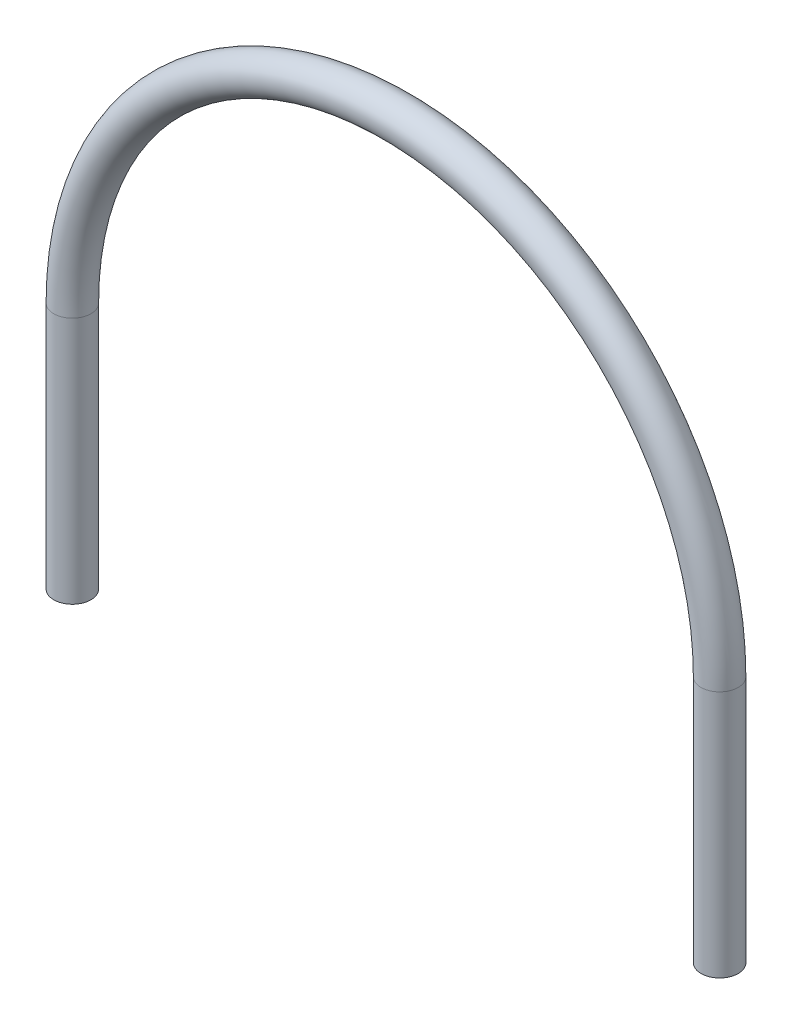
ISO-10303-21;
HEADER;
FILE_DESCRIPTION(('STEP AP214'),'2;1');
FILE_NAME('part.step','',(''),(''),'','','');
FILE_SCHEMA(('AUTOMOTIVE_DESIGN { 1 0 10303 214 1 1 1 1 }'));
ENDSEC;
DATA;
#1=APPLICATION_CONTEXT('core data for automotive mechanical design processes');
#2=APPLICATION_PROTOCOL_DEFINITION('international standard','automotive_design',2000,#1);
#3=PRODUCT_CONTEXT('',#1,'mechanical');
#4=PRODUCT('Part','Part','',(#3));
#5=PRODUCT_RELATED_PRODUCT_CATEGORY('part','',(#4));
#6=PRODUCT_DEFINITION_FORMATION('','',#4);
#7=PRODUCT_DEFINITION_CONTEXT('part definition',#1,'design');
#8=PRODUCT_DEFINITION('design','',#6,#7);
#9=PRODUCT_DEFINITION_SHAPE('','',#8);
#10=(LENGTH_UNIT() NAMED_UNIT(*) SI_UNIT(.MILLI.,.METRE.));
#11=(NAMED_UNIT(*) PLANE_ANGLE_UNIT() SI_UNIT($,.RADIAN.));
#12=(NAMED_UNIT(*) SI_UNIT($,.STERADIAN.) SOLID_ANGLE_UNIT());
#13=UNCERTAINTY_MEASURE_WITH_UNIT(LENGTH_MEASURE(1.E-05),#10,'distance_accuracy_value','');
#14=(GEOMETRIC_REPRESENTATION_CONTEXT(3) GLOBAL_UNCERTAINTY_ASSIGNED_CONTEXT((#13)) GLOBAL_UNIT_ASSIGNED_CONTEXT((#10,
#11,#12)) REPRESENTATION_CONTEXT('',''));
#15=CARTESIAN_POINT('',(0.,0.,0.));
#16=DIRECTION('',(0.,0.,1.));
#17=DIRECTION('',(1.,0.,0.));
#18=AXIS2_PLACEMENT_3D('',#15,#16,#17);
#19=CARTESIAN_POINT('',(1589.23291946056,-400.,0.));
#20=DIRECTION('',(0.,-1.,0.));
#21=DIRECTION('',(0.,0.,1.));
#22=AXIS2_PLACEMENT_3D('',#19,#20,#21);
#23=PLANE('',#22);
#24=CARTESIAN_POINT('',(1589.23291946056,-400.,0.));
#25=DIRECTION('',(0.,-1.,0.));
#26=DIRECTION('',(0.,0.,-1.));
#27=AXIS2_PLACEMENT_3D('',#24,#25,#26);
#28=CIRCLE('',#27,27.);
#29=CARTESIAN_POINT('',(1589.23291946056,-400.,-27.));
#30=VERTEX_POINT('',#29);
#31=EDGE_CURVE('E38',#30,#30,#28,.T.);
#32=ORIENTED_EDGE('',*,*,#31,.F.);
#33=EDGE_LOOP('',(#32));
#34=FACE_BOUND('',#33,.T.);
#35=CARTESIAN_POINT('',(1589.23291946056,-400.,0.));
#36=DIRECTION('',(0.,-1.,0.));
#37=DIRECTION('',(0.,0.,1.));
#38=AXIS2_PLACEMENT_3D('',#35,#36,#37);
#39=CIRCLE('',#38,30.);
#40=CARTESIAN_POINT('',(1589.23291946056,-400.,30.));
#41=VERTEX_POINT('',#40);
#42=EDGE_CURVE('E29',#41,#41,#39,.T.);
#43=ORIENTED_EDGE('',*,*,#42,.T.);
#44=EDGE_LOOP('',(#43));
#45=FACE_BOUND('',#44,.T.);
#46=ADVANCED_FACE('F15',(#34,#45),#23,.T.);
#47=CARTESIAN_POINT('',(544.23291946056,-400.,0.));
#48=DIRECTION('',(0.,1.,0.));
#49=DIRECTION('',(0.,0.,1.));
#50=AXIS2_PLACEMENT_3D('',#47,#48,#49);
#51=PLANE('',#50);
#52=CARTESIAN_POINT('',(544.23291946056,-400.,0.));
#53=DIRECTION('',(0.,1.,0.));
#54=DIRECTION('',(0.,0.,1.));
#55=AXIS2_PLACEMENT_3D('',#52,#53,#54);
#56=CIRCLE('',#55,27.);
#57=CARTESIAN_POINT('',(544.23291946056,-400.,27.));
#58=VERTEX_POINT('',#57);
#59=EDGE_CURVE('E34',#58,#58,#56,.T.);
#60=ORIENTED_EDGE('',*,*,#59,.T.);
#61=EDGE_LOOP('',(#60));
#62=FACE_BOUND('',#61,.T.);
#63=CARTESIAN_POINT('',(544.23291946056,-400.,0.));
#64=DIRECTION('',(0.,1.,0.));
#65=DIRECTION('',(0.,0.,1.));
#66=AXIS2_PLACEMENT_3D('',#63,#64,#65);
#67=CIRCLE('',#66,30.);
#68=CARTESIAN_POINT('',(544.23291946056,-400.,30.));
#69=VERTEX_POINT('',#68);
#70=EDGE_CURVE('E10',#69,#69,#67,.T.);
#71=ORIENTED_EDGE('',*,*,#70,.F.);
#72=EDGE_LOOP('',(#71));
#73=FACE_BOUND('',#72,.T.);
#74=ADVANCED_FACE('F58',(#62,#73),#51,.F.);
#75=CARTESIAN_POINT('',(1589.23291946056,-400.,0.));
#76=DIRECTION('',(0.,1.,0.));
#77=DIRECTION('',(0.,0.,1.));
#78=AXIS2_PLACEMENT_3D('',#75,#76,#77);
#79=CYLINDRICAL_SURFACE('',#78,30.);
#80=CARTESIAN_POINT('',(1589.23291946056,0.,0.));
#81=DIRECTION('',(0.,-1.,0.));
#82=DIRECTION('',(0.,0.,1.));
#83=AXIS2_PLACEMENT_3D('',#80,#81,#82);
#84=CIRCLE('',#83,30.);
#85=CARTESIAN_POINT('',(1619.23291946056,0.,0.));
#86=VERTEX_POINT('',#85);
#87=EDGE_CURVE('E25',#86,#86,#84,.T.);
#88=ORIENTED_EDGE('',*,*,#87,.T.);
#89=EDGE_LOOP('',(#88));
#90=FACE_BOUND('',#89,.T.);
#91=ORIENTED_EDGE('',*,*,#42,.F.);
#92=EDGE_LOOP('',(#91));
#93=FACE_BOUND('',#92,.T.);
#94=ADVANCED_FACE('F62',(#90,#93),#79,.T.);
#95=CARTESIAN_POINT('',(1066.73291946056,1.55485551236084E-13,0.));
#96=DIRECTION('',(0.,0.,1.));
#97=DIRECTION('',(1.,0.,0.));
#98=AXIS2_PLACEMENT_3D('',#95,#96,#97);
#99=TOROIDAL_SURFACE('',#98,522.5,30.);
#100=CARTESIAN_POINT('',(544.23291946056,1.66533453693773E-13,0.));
#101=DIRECTION('',(0.,1.,0.));
#102=DIRECTION('',(0.,0.,1.));
#103=AXIS2_PLACEMENT_3D('',#100,#101,#102);
#104=CIRCLE('',#103,30.);
#105=CARTESIAN_POINT('',(514.23291946056,1.67167783021488E-13,0.));
#106=VERTEX_POINT('',#105);
#107=EDGE_CURVE('E21',#106,#106,#104,.T.);
#108=CARTESIAN_POINT('',(1066.73291946056,1.55485551236084E-13,0.));
#109=DIRECTION('',(0.,0.,1.));
#110=DIRECTION('',(1.,0.,0.));
#111=AXIS2_PLACEMENT_3D('',#108,#109,#110);
#112=CIRCLE('',#111,552.5);
#113=EDGE_CURVE('',#86,#106,#112,.T.);
#114=ORIENTED_EDGE('',*,*,#87,.F.);
#115=ORIENTED_EDGE('',*,*,#107,.T.);
#116=ORIENTED_EDGE('',*,*,#113,.T.);
#117=ORIENTED_EDGE('',*,*,#113,.F.);
#118=EDGE_LOOP('',(#114,#116,#115,#117));
#119=FACE_BOUND('',#118,.T.);
#120=ADVANCED_FACE('F64',(#119),#99,.T.);
#121=CARTESIAN_POINT('',(544.23291946056,1.66533453693773E-13,0.));
#122=DIRECTION('',(0.,-1.,0.));
#123=DIRECTION('',(0.,0.,-1.));
#124=AXIS2_PLACEMENT_3D('',#121,#122,#123);
#125=CYLINDRICAL_SURFACE('',#124,30.);
#126=ORIENTED_EDGE('',*,*,#70,.T.);
#127=EDGE_LOOP('',(#126));
#128=FACE_BOUND('',#127,.T.);
#129=ORIENTED_EDGE('',*,*,#107,.F.);
#130=EDGE_LOOP('',(#129));
#131=FACE_BOUND('',#130,.T.);
#132=ADVANCED_FACE('F52',(#128,#131),#125,.T.);
#133=CARTESIAN_POINT('',(1589.23291946056,-400.,0.));
#134=DIRECTION('',(0.,1.,0.));
#135=DIRECTION('',(0.,0.,1.));
#136=AXIS2_PLACEMENT_3D('',#133,#134,#135);
#137=CYLINDRICAL_SURFACE('',#136,27.);
#138=CARTESIAN_POINT('',(1589.23291946056,0.,0.));
#139=DIRECTION('',(0.,1.,0.));
#140=DIRECTION('',(0.,0.,1.));
#141=AXIS2_PLACEMENT_3D('',#138,#139,#140);
#142=CIRCLE('',#141,27.);
#143=CARTESIAN_POINT('',(1616.23291946056,0.,0.));
#144=VERTEX_POINT('',#143);
#145=EDGE_CURVE('E41',#144,#144,#142,.F.);
#146=ORIENTED_EDGE('',*,*,#145,.F.);
#147=EDGE_LOOP('',(#146));
#148=FACE_BOUND('',#147,.T.);
#149=ORIENTED_EDGE('',*,*,#31,.T.);
#150=EDGE_LOOP('',(#149));
#151=FACE_BOUND('',#150,.T.);
#152=ADVANCED_FACE('F49',(#148,#151),#137,.F.);
#153=CARTESIAN_POINT('',(1066.73291946056,1.55485551236084E-13,0.));
#154=DIRECTION('',(0.,0.,1.));
#155=DIRECTION('',(1.,0.,0.));
#156=AXIS2_PLACEMENT_3D('',#153,#154,#155);
#157=TOROIDAL_SURFACE('',#156,522.5,27.);
#158=CARTESIAN_POINT('',(544.23291946056,2.19473346491534E-13,0.));
#159=DIRECTION('',(0.,1.,0.));
#160=DIRECTION('',(-1.,0.,0.));
#161=AXIS2_PLACEMENT_3D('',#158,#159,#160);
#162=CIRCLE('',#161,27.);
#163=CARTESIAN_POINT('',(517.23291946056,2.22779892849232E-13,0.));
#164=VERTEX_POINT('',#163);
#165=EDGE_CURVE('E37',#164,#164,#162,.T.);
#166=CARTESIAN_POINT('',(1066.73291946056,1.55485551236084E-13,0.));
#167=DIRECTION('',(0.,0.,1.));
#168=DIRECTION('',(1.,0.,0.));
#169=AXIS2_PLACEMENT_3D('',#166,#167,#168);
#170=CIRCLE('',#169,549.5);
#171=EDGE_CURVE('',#144,#164,#170,.T.);
#172=ORIENTED_EDGE('',*,*,#145,.T.);
#173=ORIENTED_EDGE('',*,*,#165,.F.);
#174=ORIENTED_EDGE('',*,*,#171,.T.);
#175=ORIENTED_EDGE('',*,*,#171,.F.);
#176=EDGE_LOOP('',(#172,#174,#173,#175));
#177=FACE_BOUND('',#176,.T.);
#178=ADVANCED_FACE('F47',(#177),#157,.F.);
#179=CARTESIAN_POINT('',(544.23291946056,1.66533453693773E-13,0.));
#180=DIRECTION('',(0.,-1.,0.));
#181=DIRECTION('',(0.,0.,-1.));
#182=AXIS2_PLACEMENT_3D('',#179,#180,#181);
#183=CYLINDRICAL_SURFACE('',#182,27.);
#184=ORIENTED_EDGE('',*,*,#59,.F.);
#185=EDGE_LOOP('',(#184));
#186=FACE_BOUND('',#185,.T.);
#187=ORIENTED_EDGE('',*,*,#165,.T.);
#188=EDGE_LOOP('',(#187));
#189=FACE_BOUND('',#188,.T.);
#190=ADVANCED_FACE('F59',(#186,#189),#183,.F.);
#191=CLOSED_SHELL('',(#46,#74,#94,#120,#132,#152,#178,#190));
#192=MANIFOLD_SOLID_BREP('B1',#191);
#193=ADVANCED_BREP_SHAPE_REPRESENTATION('',(#18,#192),#14);
#194=SHAPE_DEFINITION_REPRESENTATION(#9,#193);
ENDSEC;
END-ISO-10303-21;
